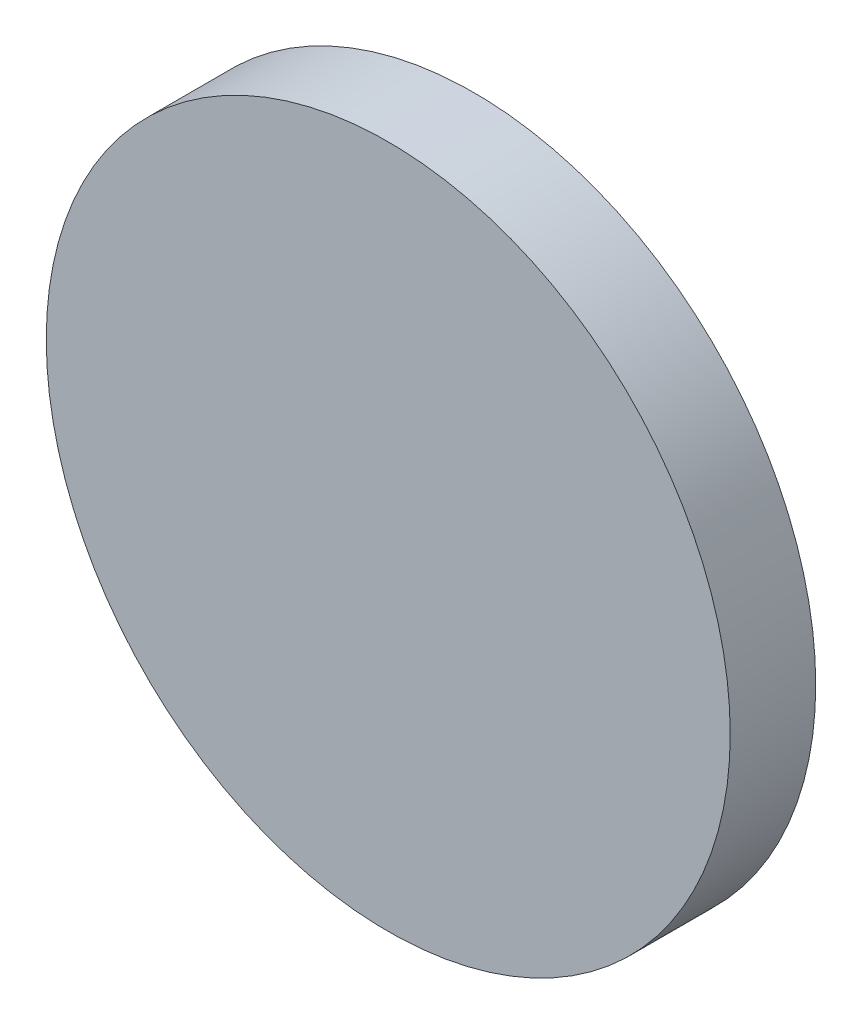
ISO-10303-21;
HEADER;
FILE_DESCRIPTION(('STEP AP214'),'2;1');
FILE_NAME('part.step','',(''),(''),'','','');
FILE_SCHEMA(('AUTOMOTIVE_DESIGN { 1 0 10303 214 1 1 1 1 }'));
ENDSEC;
DATA;
#1=APPLICATION_CONTEXT('core data for automotive mechanical design processes');
#2=APPLICATION_PROTOCOL_DEFINITION('international standard','automotive_design',2000,#1);
#3=PRODUCT_CONTEXT('',#1,'mechanical');
#4=PRODUCT('Part','Part','',(#3));
#5=PRODUCT_RELATED_PRODUCT_CATEGORY('part','',(#4));
#6=PRODUCT_DEFINITION_FORMATION('','',#4);
#7=PRODUCT_DEFINITION_CONTEXT('part definition',#1,'design');
#8=PRODUCT_DEFINITION('design','',#6,#7);
#9=PRODUCT_DEFINITION_SHAPE('','',#8);
#10=(LENGTH_UNIT() NAMED_UNIT(*) SI_UNIT(.MILLI.,.METRE.));
#11=(NAMED_UNIT(*) PLANE_ANGLE_UNIT() SI_UNIT($,.RADIAN.));
#12=(NAMED_UNIT(*) SI_UNIT($,.STERADIAN.) SOLID_ANGLE_UNIT());
#13=UNCERTAINTY_MEASURE_WITH_UNIT(LENGTH_MEASURE(1.E-05),#10,'distance_accuracy_value','');
#14=(GEOMETRIC_REPRESENTATION_CONTEXT(3) GLOBAL_UNCERTAINTY_ASSIGNED_CONTEXT((#13)) GLOBAL_UNIT_ASSIGNED_CONTEXT((#10,
#11,#12)) REPRESENTATION_CONTEXT('',''));
#15=CARTESIAN_POINT('',(0.,0.,0.));
#16=DIRECTION('',(0.,0.,1.));
#17=DIRECTION('',(1.,0.,0.));
#18=AXIS2_PLACEMENT_3D('',#15,#16,#17);
#19=CARTESIAN_POINT('',(0.,0.,6.35));
#20=DIRECTION('',(0.,0.,-1.));
#21=DIRECTION('',(-1.,0.,0.));
#22=AXIS2_PLACEMENT_3D('',#19,#20,#21);
#23=CYLINDRICAL_SURFACE('',#22,25.4);
#24=CARTESIAN_POINT('',(0.,0.,6.35));
#25=DIRECTION('',(0.,0.,1.));
#26=DIRECTION('',(1.,0.,0.));
#27=AXIS2_PLACEMENT_3D('',#24,#25,#26);
#28=CIRCLE('',#27,25.4);
#29=CARTESIAN_POINT('',(25.4,0.,6.35));
#30=VERTEX_POINT('',#29);
#31=EDGE_CURVE('E10',#30,#30,#28,.T.);
#32=ORIENTED_EDGE('',*,*,#31,.F.);
#33=EDGE_LOOP('',(#32));
#34=FACE_BOUND('',#33,.T.);
#35=CARTESIAN_POINT('',(0.,0.,0.));
#36=DIRECTION('',(0.,0.,1.));
#37=DIRECTION('',(1.,0.,0.));
#38=AXIS2_PLACEMENT_3D('',#35,#36,#37);
#39=CIRCLE('',#38,25.4);
#40=CARTESIAN_POINT('',(25.4,0.,0.));
#41=VERTEX_POINT('',#40);
#42=EDGE_CURVE('E36',#41,#41,#39,.T.);
#43=ORIENTED_EDGE('',*,*,#42,.T.);
#44=EDGE_LOOP('',(#43));
#45=FACE_BOUND('',#44,.T.);
#46=ADVANCED_FACE('F33',(#34,#45),#23,.T.);
#47=CARTESIAN_POINT('',(0.,0.,6.35));
#48=DIRECTION('',(0.,0.,1.));
#49=DIRECTION('',(1.,0.,0.));
#50=AXIS2_PLACEMENT_3D('',#47,#48,#49);
#51=PLANE('',#50);
#52=ORIENTED_EDGE('',*,*,#31,.T.);
#53=EDGE_LOOP('',(#52));
#54=FACE_BOUND('',#53,.T.);
#55=ADVANCED_FACE('F48',(#54),#51,.T.);
#56=CARTESIAN_POINT('',(0.,0.,0.));
#57=DIRECTION('',(0.,0.,1.));
#58=DIRECTION('',(1.,0.,0.));
#59=AXIS2_PLACEMENT_3D('',#56,#57,#58);
#60=PLANE('',#59);
#61=ORIENTED_EDGE('',*,*,#42,.F.);
#62=EDGE_LOOP('',(#61));
#63=FACE_BOUND('',#62,.T.);
#64=ADVANCED_FACE('F46',(#63),#60,.F.);
#65=CLOSED_SHELL('',(#46,#55,#64));
#66=MANIFOLD_SOLID_BREP('B2',#65);
#67=ADVANCED_BREP_SHAPE_REPRESENTATION('',(#18,#66),#14);
#68=SHAPE_DEFINITION_REPRESENTATION(#9,#67);
ENDSEC;
END-ISO-10303-21;
